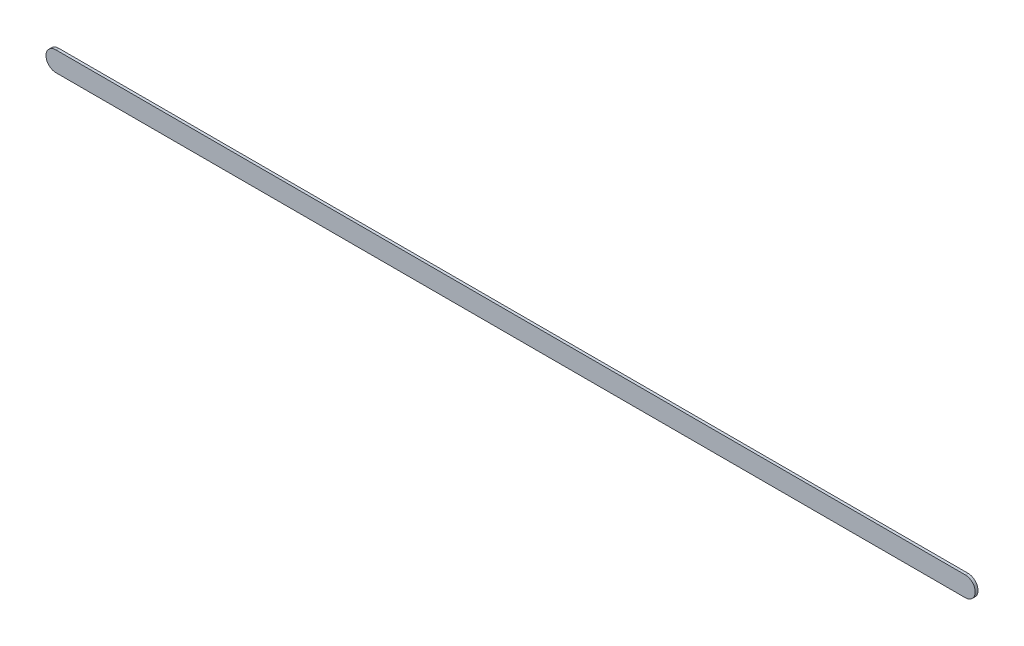
ISO-10303-21;
HEADER;
FILE_DESCRIPTION(('STEP AP214'),'2;1');
FILE_NAME('part.step','',(''),(''),'','','');
FILE_SCHEMA(('AUTOMOTIVE_DESIGN { 1 0 10303 214 1 1 1 1 }'));
ENDSEC;
DATA;
#1=APPLICATION_CONTEXT('core data for automotive mechanical design processes');
#2=APPLICATION_PROTOCOL_DEFINITION('international standard','automotive_design',2000,#1);
#3=PRODUCT_CONTEXT('',#1,'mechanical');
#4=PRODUCT('Part','Part','',(#3));
#5=PRODUCT_RELATED_PRODUCT_CATEGORY('part','',(#4));
#6=PRODUCT_DEFINITION_FORMATION('','',#4);
#7=PRODUCT_DEFINITION_CONTEXT('part definition',#1,'design');
#8=PRODUCT_DEFINITION('design','',#6,#7);
#9=PRODUCT_DEFINITION_SHAPE('','',#8);
#10=(LENGTH_UNIT() NAMED_UNIT(*) SI_UNIT(.MILLI.,.METRE.));
#11=(NAMED_UNIT(*) PLANE_ANGLE_UNIT() SI_UNIT($,.RADIAN.));
#12=(NAMED_UNIT(*) SI_UNIT($,.STERADIAN.) SOLID_ANGLE_UNIT());
#13=UNCERTAINTY_MEASURE_WITH_UNIT(LENGTH_MEASURE(1.E-05),#10,'distance_accuracy_value','');
#14=(GEOMETRIC_REPRESENTATION_CONTEXT(3) GLOBAL_UNCERTAINTY_ASSIGNED_CONTEXT((#13)) GLOBAL_UNIT_ASSIGNED_CONTEXT((#10,
#11,#12)) REPRESENTATION_CONTEXT('',''));
#15=CARTESIAN_POINT('',(0.,0.,0.));
#16=DIRECTION('',(0.,0.,1.));
#17=DIRECTION('',(1.,0.,0.));
#18=AXIS2_PLACEMENT_3D('',#15,#16,#17);
#19=CARTESIAN_POINT('',(82.81697178,50.85997194,0.));
#20=DIRECTION('',(0.,1.,0.));
#21=DIRECTION('',(1.,0.,0.));
#22=AXIS2_PLACEMENT_3D('',#19,#20,#21);
#23=PLANE('',#22);
#24=DIRECTION('',(1.,0.,0.));
#25=VECTOR('',#24,1.);
#26=CARTESIAN_POINT('',(82.81697178,50.85997194,0.03556));
#27=LINE('',#26,#25);
#28=CARTESIAN_POINT('',(82.81697178,50.85997194,0.03556));
#29=VERTEX_POINT('',#28);
#30=CARTESIAN_POINT('',(94.47698656,50.85997194,0.03556));
#31=VERTEX_POINT('',#30);
#32=EDGE_CURVE('E11',#29,#31,#27,.T.);
#33=ORIENTED_EDGE('',*,*,#32,.F.);
#34=DIRECTION('',(0.,0.,1.));
#35=VECTOR('',#34,1.);
#36=CARTESIAN_POINT('',(82.81697178,50.85997194,0.));
#37=LINE('',#36,#35);
#38=CARTESIAN_POINT('',(82.81697178,50.85997194,0.));
#39=VERTEX_POINT('',#38);
#40=EDGE_CURVE('E24',#39,#29,#37,.T.);
#41=ORIENTED_EDGE('',*,*,#40,.F.);
#42=DIRECTION('',(1.,0.,0.));
#43=VECTOR('',#42,1.);
#44=CARTESIAN_POINT('',(82.81697178,50.85997194,0.));
#45=LINE('',#44,#43);
#46=CARTESIAN_POINT('',(94.47698656,50.85997194,0.));
#47=VERTEX_POINT('',#46);
#48=EDGE_CURVE('E75',#39,#47,#45,.T.);
#49=ORIENTED_EDGE('',*,*,#48,.T.);
#50=DIRECTION('',(0.,0.,1.));
#51=VECTOR('',#50,1.);
#52=CARTESIAN_POINT('',(94.47698656,50.85997194,0.));
#53=LINE('',#52,#51);
#54=EDGE_CURVE('E37',#47,#31,#53,.T.);
#55=ORIENTED_EDGE('',*,*,#54,.T.);
#56=EDGE_LOOP('',(#33,#41,#49,#55));
#57=FACE_BOUND('',#56,.T.);
#58=ADVANCED_FACE('F17',(#57),#23,.F.);
#59=CARTESIAN_POINT('',(94.47698656,50.98697194,0.));
#60=DIRECTION('',(0.,0.,-1.));
#61=DIRECTION('',(0.,-1.,0.));
#62=AXIS2_PLACEMENT_3D('',#59,#60,#61);
#63=CYLINDRICAL_SURFACE('',#62,0.126999999999998);
#64=CARTESIAN_POINT('',(94.47698656,50.98697194,0.03556));
#65=DIRECTION('',(0.,0.,1.));
#66=DIRECTION('',(0.,-1.,0.));
#67=AXIS2_PLACEMENT_3D('',#64,#65,#66);
#68=CIRCLE('',#67,0.126999999999998);
#69=CARTESIAN_POINT('',(94.47698656,51.11397194,0.03556));
#70=VERTEX_POINT('',#69);
#71=EDGE_CURVE('E83',#31,#70,#68,.T.);
#72=ORIENTED_EDGE('',*,*,#71,.F.);
#73=ORIENTED_EDGE('',*,*,#54,.F.);
#74=CARTESIAN_POINT('',(94.47698656,50.98697194,0.));
#75=DIRECTION('',(0.,0.,1.));
#76=DIRECTION('',(0.,-1.,0.));
#77=AXIS2_PLACEMENT_3D('',#74,#75,#76);
#78=CIRCLE('',#77,0.126999999999998);
#79=CARTESIAN_POINT('',(94.47698656,51.11397194,0.));
#80=VERTEX_POINT('',#79);
#81=EDGE_CURVE('E81',#47,#80,#78,.T.);
#82=ORIENTED_EDGE('',*,*,#81,.T.);
#83=DIRECTION('',(0.,0.,1.));
#84=VECTOR('',#83,1.);
#85=CARTESIAN_POINT('',(94.47698656,51.11397194,0.));
#86=LINE('',#85,#84);
#87=EDGE_CURVE('E67',#80,#70,#86,.T.);
#88=ORIENTED_EDGE('',*,*,#87,.T.);
#89=EDGE_LOOP('',(#72,#73,#82,#88));
#90=FACE_BOUND('',#89,.T.);
#91=ADVANCED_FACE('F89',(#90),#63,.T.);
#92=CARTESIAN_POINT('',(94.47698656,51.11397194,0.));
#93=DIRECTION('',(0.,-1.,0.));
#94=DIRECTION('',(-1.,0.,0.));
#95=AXIS2_PLACEMENT_3D('',#92,#93,#94);
#96=PLANE('',#95);
#97=DIRECTION('',(-1.,0.,0.));
#98=VECTOR('',#97,1.);
#99=CARTESIAN_POINT('',(94.47698656,51.11397194,0.03556));
#100=LINE('',#99,#98);
#101=CARTESIAN_POINT('',(82.81697178,51.11397194,0.03556));
#102=VERTEX_POINT('',#101);
#103=EDGE_CURVE('E71',#70,#102,#100,.T.);
#104=ORIENTED_EDGE('',*,*,#103,.F.);
#105=ORIENTED_EDGE('',*,*,#87,.F.);
#106=DIRECTION('',(-1.,0.,0.));
#107=VECTOR('',#106,1.);
#108=CARTESIAN_POINT('',(94.47698656,51.11397194,0.));
#109=LINE('',#108,#107);
#110=CARTESIAN_POINT('',(82.81697178,51.11397194,0.));
#111=VERTEX_POINT('',#110);
#112=EDGE_CURVE('E63',#80,#111,#109,.T.);
#113=ORIENTED_EDGE('',*,*,#112,.T.);
#114=DIRECTION('',(0.,0.,1.));
#115=VECTOR('',#114,1.);
#116=CARTESIAN_POINT('',(82.81697178,51.11397194,0.));
#117=LINE('',#116,#115);
#118=EDGE_CURVE('E53',#111,#102,#117,.T.);
#119=ORIENTED_EDGE('',*,*,#118,.T.);
#120=EDGE_LOOP('',(#104,#105,#113,#119));
#121=FACE_BOUND('',#120,.T.);
#122=ADVANCED_FACE('F66',(#121),#96,.F.);
#123=CARTESIAN_POINT('',(82.81697178,50.98697194,0.));
#124=DIRECTION('',(0.,0.,-1.));
#125=DIRECTION('',(1.11896493820492E-13,1.,0.));
#126=AXIS2_PLACEMENT_3D('',#123,#124,#125);
#127=CYLINDRICAL_SURFACE('',#126,0.126999999999998);
#128=CARTESIAN_POINT('',(82.81697178,50.98697194,0.03556));
#129=DIRECTION('',(0.,0.,1.));
#130=DIRECTION('',(1.11896493820492E-13,1.,0.));
#131=AXIS2_PLACEMENT_3D('',#128,#129,#130);
#132=CIRCLE('',#131,0.126999999999998);
#133=EDGE_CURVE('E59',#102,#29,#132,.T.);
#134=ORIENTED_EDGE('',*,*,#133,.F.);
#135=ORIENTED_EDGE('',*,*,#118,.F.);
#136=CARTESIAN_POINT('',(82.81697178,50.98697194,0.));
#137=DIRECTION('',(0.,0.,1.));
#138=DIRECTION('',(1.11896493820492E-13,1.,0.));
#139=AXIS2_PLACEMENT_3D('',#136,#137,#138);
#140=CIRCLE('',#139,0.126999999999998);
#141=EDGE_CURVE('E57',#111,#39,#140,.T.);
#142=ORIENTED_EDGE('',*,*,#141,.T.);
#143=ORIENTED_EDGE('',*,*,#40,.T.);
#144=EDGE_LOOP('',(#134,#135,#142,#143));
#145=FACE_BOUND('',#144,.T.);
#146=ADVANCED_FACE('F55',(#145),#127,.T.);
#147=CARTESIAN_POINT('',(82.81697178,50.85997194,0.));
#148=DIRECTION('',(0.,0.,-1.));
#149=DIRECTION('',(-1.,0.,0.));
#150=AXIS2_PLACEMENT_3D('',#147,#148,#149);
#151=PLANE('',#150);
#152=ORIENTED_EDGE('',*,*,#141,.F.);
#153=ORIENTED_EDGE('',*,*,#112,.F.);
#154=ORIENTED_EDGE('',*,*,#81,.F.);
#155=ORIENTED_EDGE('',*,*,#48,.F.);
#156=EDGE_LOOP('',(#152,#153,#154,#155));
#157=FACE_BOUND('',#156,.T.);
#158=ADVANCED_FACE('F74',(#157),#151,.T.);
#159=CARTESIAN_POINT('',(82.81697178,50.85997194,0.03556));
#160=DIRECTION('',(0.,0.,-1.));
#161=DIRECTION('',(-1.,0.,0.));
#162=AXIS2_PLACEMENT_3D('',#159,#160,#161);
#163=PLANE('',#162);
#164=ORIENTED_EDGE('',*,*,#32,.T.);
#165=ORIENTED_EDGE('',*,*,#71,.T.);
#166=ORIENTED_EDGE('',*,*,#103,.T.);
#167=ORIENTED_EDGE('',*,*,#133,.T.);
#168=EDGE_LOOP('',(#164,#165,#166,#167));
#169=FACE_BOUND('',#168,.T.);
#170=ADVANCED_FACE('F91',(#169),#163,.F.);
#171=CLOSED_SHELL('',(#58,#91,#122,#146,#158,#170));
#172=MANIFOLD_SOLID_BREP('B1',#171);
#173=ADVANCED_BREP_SHAPE_REPRESENTATION('',(#18,#172),#14);
#174=SHAPE_DEFINITION_REPRESENTATION(#9,#173);
ENDSEC;
END-ISO-10303-21;
